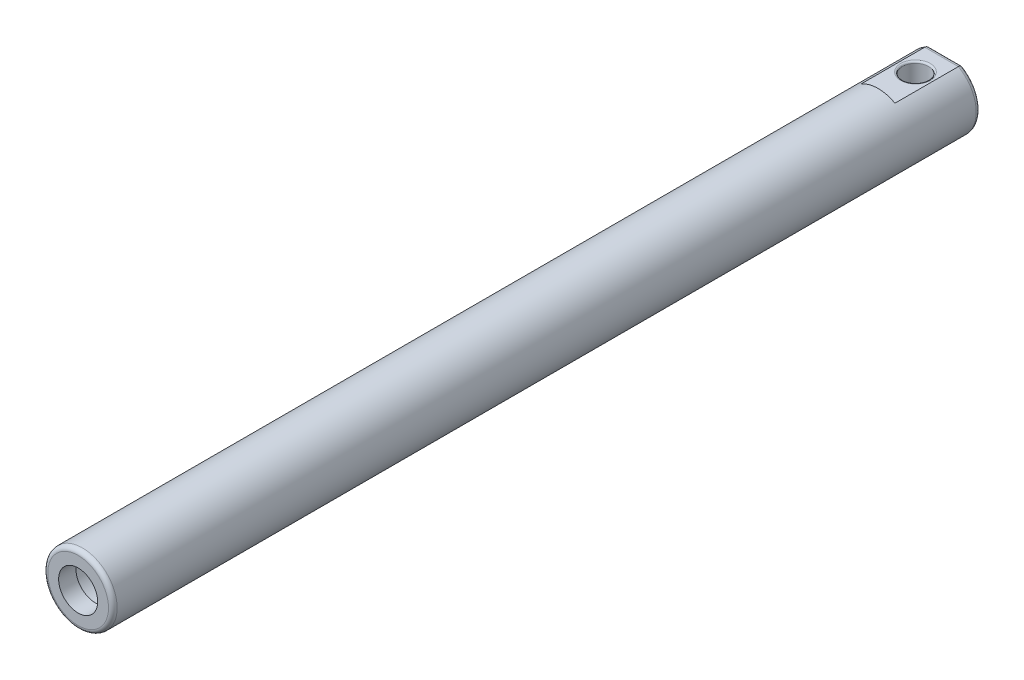
ISO-10303-21;
HEADER;
FILE_DESCRIPTION(('STEP AP214'),'2;1');
FILE_NAME('part.step','',(''),(''),'','','');
FILE_SCHEMA(('AUTOMOTIVE_DESIGN { 1 0 10303 214 1 1 1 1 }'));
ENDSEC;
DATA;
#1=APPLICATION_CONTEXT('core data for automotive mechanical design processes');
#2=APPLICATION_PROTOCOL_DEFINITION('international standard','automotive_design',2000,#1);
#3=PRODUCT_CONTEXT('',#1,'mechanical');
#4=PRODUCT('Part','Part','',(#3));
#5=PRODUCT_RELATED_PRODUCT_CATEGORY('part','',(#4));
#6=PRODUCT_DEFINITION_FORMATION('','',#4);
#7=PRODUCT_DEFINITION_CONTEXT('part definition',#1,'design');
#8=PRODUCT_DEFINITION('design','',#6,#7);
#9=PRODUCT_DEFINITION_SHAPE('','',#8);
#10=(LENGTH_UNIT() NAMED_UNIT(*) SI_UNIT(.MILLI.,.METRE.));
#11=(NAMED_UNIT(*) PLANE_ANGLE_UNIT() SI_UNIT($,.RADIAN.));
#12=(NAMED_UNIT(*) SI_UNIT($,.STERADIAN.) SOLID_ANGLE_UNIT());
#13=UNCERTAINTY_MEASURE_WITH_UNIT(LENGTH_MEASURE(1.E-05),#10,'distance_accuracy_value','');
#14=(GEOMETRIC_REPRESENTATION_CONTEXT(3) GLOBAL_UNCERTAINTY_ASSIGNED_CONTEXT((#13)) GLOBAL_UNIT_ASSIGNED_CONTEXT((#10,
#11,#12)) REPRESENTATION_CONTEXT('',''));
#15=CARTESIAN_POINT('',(0.,0.,0.));
#16=DIRECTION('',(0.,0.,1.));
#17=DIRECTION('',(1.,0.,0.));
#18=AXIS2_PLACEMENT_3D('',#15,#16,#17);
#19=CARTESIAN_POINT('',(0.,0.,920.));
#20=DIRECTION('',(0.,0.,-1.));
#21=DIRECTION('',(-1.,0.,0.));
#22=AXIS2_PLACEMENT_3D('',#19,#20,#21);
#23=CYLINDRICAL_SURFACE('',#22,40.);
#24=CARTESIAN_POINT('',(0.,0.,915.));
#25=DIRECTION('',(0.,0.,1.));
#26=DIRECTION('',(1.,0.,0.));
#27=AXIS2_PLACEMENT_3D('',#24,#25,#26);
#28=CIRCLE('',#27,40.);
#29=CARTESIAN_POINT('',(40.,0.,915.));
#30=VERTEX_POINT('',#29);
#31=EDGE_CURVE('E182',#30,#30,#28,.F.);
#32=ORIENTED_EDGE('',*,*,#31,.T.);
#33=EDGE_LOOP('',(#32));
#34=FACE_BOUND('',#33,.T.);
#35=DIRECTION('',(0.,0.,-1.));
#36=VECTOR('',#35,1.);
#37=CARTESIAN_POINT('',(19.3649167310371,-35.,920.));
#38=LINE('',#37,#36);
#39=CARTESIAN_POINT('',(19.3649167310371,-35.,-2.));
#40=VERTEX_POINT('',#39);
#41=CARTESIAN_POINT('',(19.3649167310371,-35.,-75.));
#42=VERTEX_POINT('',#41);
#43=EDGE_CURVE('E115',#40,#42,#38,.T.);
#44=ORIENTED_EDGE('',*,*,#43,.T.);
#45=CARTESIAN_POINT('',(0.,0.,-75.));
#46=DIRECTION('',(0.,0.,-1.));
#47=DIRECTION('',(-1.,0.,0.));
#48=AXIS2_PLACEMENT_3D('',#45,#46,#47);
#49=CIRCLE('',#48,40.);
#50=CARTESIAN_POINT('',(19.3649167310371,35.,-75.));
#51=VERTEX_POINT('',#50);
#52=EDGE_CURVE('E75',#42,#51,#49,.F.);
#53=ORIENTED_EDGE('',*,*,#52,.T.);
#54=DIRECTION('',(0.,0.,-1.));
#55=VECTOR('',#54,1.);
#56=CARTESIAN_POINT('',(19.3649167310371,35.,920.));
#57=LINE('',#56,#55);
#58=CARTESIAN_POINT('',(19.3649167310371,35.,-2.));
#59=VERTEX_POINT('',#58);
#60=EDGE_CURVE('E140',#51,#59,#57,.F.);
#61=ORIENTED_EDGE('',*,*,#60,.T.);
#62=CARTESIAN_POINT('',(0.,0.,-2.));
#63=DIRECTION('',(0.,0.,1.));
#64=DIRECTION('',(1.,0.,0.));
#65=AXIS2_PLACEMENT_3D('',#62,#63,#64);
#66=CIRCLE('',#65,40.);
#67=CARTESIAN_POINT('',(-19.3649167310371,35.,-2.));
#68=VERTEX_POINT('',#67);
#69=EDGE_CURVE('E123',#59,#68,#66,.T.);
#70=ORIENTED_EDGE('',*,*,#69,.T.);
#71=DIRECTION('',(0.,0.,-1.));
#72=VECTOR('',#71,1.);
#73=CARTESIAN_POINT('',(-19.3649167310371,35.,920.));
#74=LINE('',#73,#72);
#75=CARTESIAN_POINT('',(-19.3649167310371,35.,-75.));
#76=VERTEX_POINT('',#75);
#77=EDGE_CURVE('E143',#68,#76,#74,.T.);
#78=ORIENTED_EDGE('',*,*,#77,.T.);
#79=CARTESIAN_POINT('',(0.,0.,-75.));
#80=DIRECTION('',(0.,0.,-1.));
#81=DIRECTION('',(-1.,0.,0.));
#82=AXIS2_PLACEMENT_3D('',#79,#80,#81);
#83=CIRCLE('',#82,40.);
#84=CARTESIAN_POINT('',(-19.3649167310371,-35.,-75.));
#85=VERTEX_POINT('',#84);
#86=EDGE_CURVE('E109',#76,#85,#83,.F.);
#87=ORIENTED_EDGE('',*,*,#86,.T.);
#88=DIRECTION('',(0.,0.,-1.));
#89=VECTOR('',#88,1.);
#90=CARTESIAN_POINT('',(-19.3649167310371,-35.,920.));
#91=LINE('',#90,#89);
#92=CARTESIAN_POINT('',(-19.3649167310371,-35.,-2.));
#93=VERTEX_POINT('',#92);
#94=EDGE_CURVE('E104',#85,#93,#91,.F.);
#95=ORIENTED_EDGE('',*,*,#94,.T.);
#96=CARTESIAN_POINT('',(0.,0.,-2.));
#97=DIRECTION('',(0.,0.,-1.));
#98=DIRECTION('',(-1.,0.,0.));
#99=AXIS2_PLACEMENT_3D('',#96,#97,#98);
#100=CIRCLE('',#99,40.);
#101=EDGE_CURVE('E106',#40,#93,#100,.T.);
#102=ORIENTED_EDGE('',*,*,#101,.F.);
#103=EDGE_LOOP('',(#44,#53,#61,#70,#78,#87,#95,#102));
#104=FACE_BOUND('',#103,.T.);
#105=ADVANCED_FACE('F51',(#34,#104),#23,.T.);
#106=CARTESIAN_POINT('',(0.,0.,920.));
#107=DIRECTION('',(0.,0.,1.));
#108=DIRECTION('',(1.,0.,0.));
#109=AXIS2_PLACEMENT_3D('',#106,#107,#108);
#110=PLANE('',#109);
#111=CARTESIAN_POINT('',(0.,0.,920.));
#112=DIRECTION('',(0.,0.,1.));
#113=DIRECTION('',(1.,0.,0.));
#114=AXIS2_PLACEMENT_3D('',#111,#112,#113);
#115=CIRCLE('',#114,35.);
#116=CARTESIAN_POINT('',(35.,0.,920.));
#117=VERTEX_POINT('',#116);
#118=EDGE_CURVE('E190',#117,#117,#115,.T.);
#119=ORIENTED_EDGE('',*,*,#118,.T.);
#120=EDGE_LOOP('',(#119));
#121=FACE_BOUND('',#120,.T.);
#122=CARTESIAN_POINT('',(0.,0.,920.));
#123=DIRECTION('',(0.,0.,1.));
#124=DIRECTION('',(1.,0.,0.));
#125=AXIS2_PLACEMENT_3D('',#122,#123,#124);
#126=CIRCLE('',#125,22.5);
#127=CARTESIAN_POINT('',(22.5,0.,920.));
#128=VERTEX_POINT('',#127);
#129=EDGE_CURVE('E147',#128,#128,#126,.T.);
#130=ORIENTED_EDGE('',*,*,#129,.F.);
#131=EDGE_LOOP('',(#130));
#132=FACE_BOUND('',#131,.T.);
#133=ADVANCED_FACE('F266',(#121,#132),#110,.T.);
#134=CARTESIAN_POINT('',(0.,0.,900.));
#135=DIRECTION('',(0.,0.,-1.));
#136=DIRECTION('',(-1.,0.,0.));
#137=AXIS2_PLACEMENT_3D('',#134,#135,#136);
#138=CYLINDRICAL_SURFACE('',#137,30.);
#139=CARTESIAN_POINT('',(0.,0.,900.));
#140=DIRECTION('',(0.,0.,-1.));
#141=DIRECTION('',(-1.,0.,0.));
#142=AXIS2_PLACEMENT_3D('',#139,#140,#141);
#143=CIRCLE('',#142,30.);
#144=CARTESIAN_POINT('',(-30.,0.,900.));
#145=VERTEX_POINT('',#144);
#146=EDGE_CURVE('E151',#145,#145,#143,.T.);
#147=ORIENTED_EDGE('',*,*,#146,.F.);
#148=EDGE_LOOP('',(#147));
#149=FACE_BOUND('',#148,.T.);
#150=CARTESIAN_POINT('',(0.,0.,0.));
#151=DIRECTION('',(0.,0.,-1.));
#152=DIRECTION('',(-1.,0.,0.));
#153=AXIS2_PLACEMENT_3D('',#150,#151,#152);
#154=CIRCLE('',#153,30.);
#155=CARTESIAN_POINT('',(-30.,0.,0.));
#156=VERTEX_POINT('',#155);
#157=EDGE_CURVE('E146',#156,#156,#154,.T.);
#158=ORIENTED_EDGE('',*,*,#157,.T.);
#159=EDGE_LOOP('',(#158));
#160=FACE_BOUND('',#159,.T.);
#161=ADVANCED_FACE('F271',(#149,#160),#138,.F.);
#162=CARTESIAN_POINT('',(0.,0.,900.));
#163=DIRECTION('',(0.,0.,-1.));
#164=DIRECTION('',(-1.,0.,0.));
#165=AXIS2_PLACEMENT_3D('',#162,#163,#164);
#166=PLANE('',#165);
#167=CARTESIAN_POINT('',(0.,0.,900.));
#168=DIRECTION('',(0.,0.,-1.));
#169=DIRECTION('',(-1.,0.,0.));
#170=AXIS2_PLACEMENT_3D('',#167,#168,#169);
#171=CIRCLE('',#170,22.5);
#172=CARTESIAN_POINT('',(-22.5,0.,900.));
#173=VERTEX_POINT('',#172);
#174=EDGE_CURVE('E152',#173,#173,#171,.F.);
#175=ORIENTED_EDGE('',*,*,#174,.T.);
#176=EDGE_LOOP('',(#175));
#177=FACE_BOUND('',#176,.T.);
#178=ORIENTED_EDGE('',*,*,#146,.T.);
#179=EDGE_LOOP('',(#178));
#180=FACE_BOUND('',#179,.T.);
#181=ADVANCED_FACE('F277',(#177,#180),#166,.T.);
#182=CARTESIAN_POINT('',(0.,0.,-0.00100000000002876));
#183=DIRECTION('',(0.,0.,1.));
#184=DIRECTION('',(1.,0.,0.));
#185=AXIS2_PLACEMENT_3D('',#182,#183,#184);
#186=CYLINDRICAL_SURFACE('',#185,22.5);
#187=ORIENTED_EDGE('',*,*,#174,.F.);
#188=EDGE_LOOP('',(#187));
#189=FACE_BOUND('',#188,.T.);
#190=ORIENTED_EDGE('',*,*,#129,.T.);
#191=EDGE_LOOP('',(#190));
#192=FACE_BOUND('',#191,.T.);
#193=ADVANCED_FACE('F281',(#189,#192),#186,.F.);
#194=CARTESIAN_POINT('',(0.,0.,0.));
#195=DIRECTION('',(0.,0.,-1.));
#196=DIRECTION('',(-1.,0.,0.));
#197=AXIS2_PLACEMENT_3D('',#194,#195,#196);
#198=PLANE('',#197);
#199=ORIENTED_EDGE('',*,*,#157,.F.);
#200=EDGE_LOOP('',(#199));
#201=FACE_BOUND('',#200,.T.);
#202=ADVANCED_FACE('F285',(#201),#198,.F.);
#203=CARTESIAN_POINT('',(0.,0.,-80.));
#204=DIRECTION('',(0.,0.,-1.));
#205=DIRECTION('',(-1.,0.,0.));
#206=AXIS2_PLACEMENT_3D('',#203,#204,#205);
#207=PLANE('',#206);
#208=DIRECTION('',(-1.,0.,0.));
#209=VECTOR('',#208,1.);
#210=CARTESIAN_POINT('',(19.3649167310371,30.,-80.));
#211=LINE('',#210,#209);
#212=CARTESIAN_POINT('',(-18.0277563773199,30.,-80.));
#213=VERTEX_POINT('',#212);
#214=CARTESIAN_POINT('',(18.0277563773199,30.,-80.));
#215=VERTEX_POINT('',#214);
#216=EDGE_CURVE('E170',#213,#215,#211,.F.);
#217=ORIENTED_EDGE('',*,*,#216,.T.);
#218=CARTESIAN_POINT('',(0.,0.,-80.));
#219=DIRECTION('',(0.,0.,-1.));
#220=DIRECTION('',(-1.,0.,0.));
#221=AXIS2_PLACEMENT_3D('',#218,#219,#220);
#222=CIRCLE('',#221,35.);
#223=CARTESIAN_POINT('',(18.0277563773199,-30.,-80.));
#224=VERTEX_POINT('',#223);
#225=EDGE_CURVE('E177',#215,#224,#222,.T.);
#226=ORIENTED_EDGE('',*,*,#225,.T.);
#227=DIRECTION('',(1.,0.,0.));
#228=VECTOR('',#227,1.);
#229=CARTESIAN_POINT('',(-19.3649167310371,-30.,-80.));
#230=LINE('',#229,#228);
#231=CARTESIAN_POINT('',(-18.0277563773199,-30.,-80.));
#232=VERTEX_POINT('',#231);
#233=EDGE_CURVE('E173',#224,#232,#230,.F.);
#234=ORIENTED_EDGE('',*,*,#233,.T.);
#235=CARTESIAN_POINT('',(0.,0.,-80.));
#236=DIRECTION('',(0.,0.,-1.));
#237=DIRECTION('',(-1.,0.,0.));
#238=AXIS2_PLACEMENT_3D('',#235,#236,#237);
#239=CIRCLE('',#238,35.);
#240=EDGE_CURVE('E167',#232,#213,#239,.T.);
#241=ORIENTED_EDGE('',*,*,#240,.T.);
#242=EDGE_LOOP('',(#217,#226,#234,#241));
#243=FACE_BOUND('',#242,.T.);
#244=ADVANCED_FACE('F289',(#243),#207,.T.);
#245=CARTESIAN_POINT('',(20.,35.,-2.));
#246=DIRECTION('',(0.,0.,1.));
#247=DIRECTION('',(1.,0.,0.));
#248=AXIS2_PLACEMENT_3D('',#245,#246,#247);
#249=PLANE('',#248);
#250=DIRECTION('',(1.,0.,0.));
#251=VECTOR('',#250,1.);
#252=CARTESIAN_POINT('',(20.,35.,-2.));
#253=LINE('',#252,#251);
#254=EDGE_CURVE('E136',#68,#59,#253,.T.);
#255=ORIENTED_EDGE('',*,*,#254,.F.);
#256=ORIENTED_EDGE('',*,*,#69,.F.);
#257=EDGE_LOOP('',(#255,#256));
#258=FACE_BOUND('',#257,.T.);
#259=ADVANCED_FACE('F293',(#258),#249,.F.);
#260=CARTESIAN_POINT('',(0.,35.,0.));
#261=DIRECTION('',(0.,-1.,0.));
#262=DIRECTION('',(0.,0.,-1.));
#263=AXIS2_PLACEMENT_3D('',#260,#261,#262);
#264=PLANE('',#263);
#265=CARTESIAN_POINT('',(0.,35.,-45.));
#266=DIRECTION('',(0.,-1.,0.));
#267=DIRECTION('',(0.,0.,-1.));
#268=AXIS2_PLACEMENT_3D('',#265,#266,#267);
#269=CIRCLE('',#268,17.);
#270=CARTESIAN_POINT('',(0.,35.,-62.));
#271=VERTEX_POINT('',#270);
#272=EDGE_CURVE('E11',#271,#271,#269,.T.);
#273=ORIENTED_EDGE('',*,*,#272,.T.);
#274=EDGE_LOOP('',(#273));
#275=FACE_BOUND('',#274,.T.);
#276=ORIENTED_EDGE('',*,*,#60,.F.);
#277=DIRECTION('',(-1.,0.,0.));
#278=VECTOR('',#277,1.);
#279=CARTESIAN_POINT('',(-19.3649167310371,35.,-75.));
#280=LINE('',#279,#278);
#281=EDGE_CURVE('E67',#51,#76,#280,.T.);
#282=ORIENTED_EDGE('',*,*,#281,.T.);
#283=ORIENTED_EDGE('',*,*,#77,.F.);
#284=ORIENTED_EDGE('',*,*,#254,.T.);
#285=EDGE_LOOP('',(#276,#282,#283,#284));
#286=FACE_BOUND('',#285,.T.);
#287=ADVANCED_FACE('F263',(#275,#286),#264,.F.);
#288=CARTESIAN_POINT('',(20.,-35.,-2.));
#289=DIRECTION('',(0.,0.,-1.));
#290=DIRECTION('',(-1.,0.,0.));
#291=AXIS2_PLACEMENT_3D('',#288,#289,#290);
#292=PLANE('',#291);
#293=DIRECTION('',(1.,0.,0.));
#294=VECTOR('',#293,1.);
#295=CARTESIAN_POINT('',(20.,-35.,-2.));
#296=LINE('',#295,#294);
#297=EDGE_CURVE('E116',#93,#40,#296,.T.);
#298=ORIENTED_EDGE('',*,*,#297,.T.);
#299=ORIENTED_EDGE('',*,*,#101,.T.);
#300=EDGE_LOOP('',(#298,#299));
#301=FACE_BOUND('',#300,.T.);
#302=ADVANCED_FACE('F120',(#301),#292,.T.);
#303=CARTESIAN_POINT('',(0.,-35.,0.));
#304=DIRECTION('',(0.,1.,0.));
#305=DIRECTION('',(0.,0.,-1.));
#306=AXIS2_PLACEMENT_3D('',#303,#304,#305);
#307=PLANE('',#306);
#308=CARTESIAN_POINT('',(0.,-35.,-45.));
#309=DIRECTION('',(0.,1.,0.));
#310=DIRECTION('',(0.,0.,1.));
#311=AXIS2_PLACEMENT_3D('',#308,#309,#310);
#312=CIRCLE('',#311,17.);
#313=CARTESIAN_POINT('',(0.,-35.,-28.));
#314=VERTEX_POINT('',#313);
#315=EDGE_CURVE('E194',#314,#314,#312,.T.);
#316=ORIENTED_EDGE('',*,*,#315,.T.);
#317=EDGE_LOOP('',(#316));
#318=FACE_BOUND('',#317,.T.);
#319=ORIENTED_EDGE('',*,*,#94,.F.);
#320=DIRECTION('',(1.,0.,0.));
#321=VECTOR('',#320,1.);
#322=CARTESIAN_POINT('',(19.3649167310371,-35.,-75.));
#323=LINE('',#322,#321);
#324=EDGE_CURVE('E122',#85,#42,#323,.T.);
#325=ORIENTED_EDGE('',*,*,#324,.T.);
#326=ORIENTED_EDGE('',*,*,#43,.F.);
#327=ORIENTED_EDGE('',*,*,#297,.F.);
#328=EDGE_LOOP('',(#319,#325,#326,#327));
#329=FACE_BOUND('',#328,.T.);
#330=ADVANCED_FACE('F125',(#318,#329),#307,.F.);
#331=CARTESIAN_POINT('',(0.,-40.,-45.));
#332=DIRECTION('',(0.,1.,0.));
#333=DIRECTION('',(0.,0.,1.));
#334=AXIS2_PLACEMENT_3D('',#331,#332,#333);
#335=CYLINDRICAL_SURFACE('',#334,15.);
#336=CARTESIAN_POINT('',(0.,-33.,-45.));
#337=DIRECTION('',(0.,1.,0.));
#338=DIRECTION('',(0.,0.,1.));
#339=AXIS2_PLACEMENT_3D('',#336,#337,#338);
#340=CIRCLE('',#339,15.);
#341=CARTESIAN_POINT('',(0.,-33.,-30.));
#342=VERTEX_POINT('',#341);
#343=EDGE_CURVE('E60',#342,#342,#340,.F.);
#344=ORIENTED_EDGE('',*,*,#343,.T.);
#345=EDGE_LOOP('',(#344));
#346=FACE_BOUND('',#345,.T.);
#347=CARTESIAN_POINT('',(0.,33.,-45.));
#348=DIRECTION('',(0.,-1.,0.));
#349=DIRECTION('',(0.,0.,-1.));
#350=AXIS2_PLACEMENT_3D('',#347,#348,#349);
#351=CIRCLE('',#350,15.);
#352=CARTESIAN_POINT('',(0.,33.,-60.));
#353=VERTEX_POINT('',#352);
#354=EDGE_CURVE('E241',#353,#353,#351,.F.);
#355=ORIENTED_EDGE('',*,*,#354,.T.);
#356=EDGE_LOOP('',(#355));
#357=FACE_BOUND('',#356,.T.);
#358=ADVANCED_FACE('F248',(#346,#357),#335,.F.);
#359=CARTESIAN_POINT('',(0.,30.,-75.));
#360=DIRECTION('',(1.,0.,0.));
#361=DIRECTION('',(0.,0.,-1.));
#362=AXIS2_PLACEMENT_3D('',#359,#360,#361);
#363=CYLINDRICAL_SURFACE('',#362,5.);
#364=CARTESIAN_POINT('',(19.3649167310371,35.,-75.));
#365=CARTESIAN_POINT('',(19.3649205000472,35.0000173063587,-75.1373300823665));
#366=CARTESIAN_POINT('',(19.3634560485535,34.9943428859047,-75.2746564596589));
#367=CARTESIAN_POINT('',(19.3576181535194,34.9717364820633,-75.5483028599108));
#368=CARTESIAN_POINT('',(19.3532450243962,34.9548057154452,-75.6846229900316));
#369=CARTESIAN_POINT('',(19.3416261638452,34.9098470979698,-75.9550796892258));
#370=CARTESIAN_POINT('',(19.3343848657595,34.8818363735429,-76.089219297175));
#371=CARTESIAN_POINT('',(19.3170824375607,34.8149598614034,-76.3545774983744));
#372=CARTESIAN_POINT('',(19.3070213095175,34.776094081659,-76.4857960937687));
#373=CARTESIAN_POINT('',(19.2841501344436,34.687831589201,-76.744391346056));
#374=CARTESIAN_POINT('',(19.2713401412811,34.6384350828529,-76.8717680781803));
#375=CARTESIAN_POINT('',(19.243055117451,34.5294970244326,-77.1218544476447));
#376=CARTESIAN_POINT('',(19.227579104266,34.4699517322799,-77.244562343936));
#377=CARTESIAN_POINT('',(19.1940775483915,34.3412332572752,-77.4843930463797));
#378=CARTESIAN_POINT('',(19.1760529723852,34.2720637251054,-77.6015179477709));
#379=CARTESIAN_POINT('',(19.1375638119285,34.124597829654,-77.8295109361486));
#380=CARTESIAN_POINT('',(19.117098317491,34.046298062818,-77.9403766668469));
#381=CARTESIAN_POINT('',(19.0735926187459,33.8801456430502,-78.1564662131131));
#382=CARTESIAN_POINT('',(19.0505230515161,33.7921844263202,-78.2616006388834));
#383=CARTESIAN_POINT('',(19.002169019412,33.6081842659147,-78.4640623934138));
#384=CARTESIAN_POINT('',(18.9768837413685,33.512142357132,-78.5613868305795));
#385=CARTESIAN_POINT('',(18.9242680250719,33.3127229039831,-78.747594915808));
#386=CARTESIAN_POINT('',(18.8969377463806,33.2093459319697,-78.8364792211889));
#387=CARTESIAN_POINT('',(18.8404030529093,32.9959985980433,-79.0053126202323));
#388=CARTESIAN_POINT('',(18.8111979601327,32.8860258518291,-79.0852584524563));
#389=CARTESIAN_POINT('',(18.7192365267778,32.5405997889943,-79.3154703404752));
#390=CARTESIAN_POINT('',(18.6536900291752,32.2955480443498,-79.4505909558367));
#391=CARTESIAN_POINT('',(18.5170986094454,31.7878283565191,-79.6777186987532));
#392=CARTESIAN_POINT('',(18.4460547666256,31.5251638726303,-79.7697342643314));
#393=CARTESIAN_POINT('',(18.3180343369613,31.0547331089382,-79.8919752896393));
#394=CARTESIAN_POINT('',(18.2618464490953,30.8491792251673,-79.9317922569325));
#395=CARTESIAN_POINT('',(18.1481818780843,30.4353289121657,-79.9853665718674));
#396=CARTESIAN_POINT('',(18.0907078242059,30.2270383835736,-79.9991729045455));
#397=CARTESIAN_POINT('',(18.031267028585,30.0126587518752,-79.9999880102739));
#398=CARTESIAN_POINT('',(18.029511794121,30.0063292392071,-80.000000029633));
#399=CARTESIAN_POINT('',(18.0277563773199,30.,-80.));
#400=B_SPLINE_CURVE_WITH_KNOTS('',3,(#364,#365,#366,#367,#368,#369,#370,#371,#372,#373,#374,
#375,#376,#377,#378,#379,#380,#381,#382,#383,#384,#385,#386,#387,#388,#389,#390,#391,#392,#393,
#394,#395,#396,#397,#398,#399),.UNSPECIFIED.,.F.,.F.,(4,2,2,2,2,2,2,2,2,2,2,2,2,2,2,2,2,4),(0.,
0.411859747012875,0.823674980748592,1.23485613841729,1.64603699425728,2.05720979312632,
2.4685344483561,2.87970350246263,3.29102632450074,3.70756593899941,4.12425906962487,
4.54091972149952,4.95773191028553,5.81576637716104,6.67363280935225,7.32253664582529,
7.97021719507691,7.98992230705254),.UNSPECIFIED.);
#401=EDGE_CURVE('E131',#215,#51,#400,.F.);
#402=ORIENTED_EDGE('',*,*,#401,.F.);
#403=ORIENTED_EDGE('',*,*,#216,.F.);
#404=CARTESIAN_POINT('',(-19.3649167310371,35.,-75.));
#405=CARTESIAN_POINT('',(-19.3649205000472,35.0000173063587,-75.1373300823665));
#406=CARTESIAN_POINT('',(-19.3634560485535,34.9943428859047,-75.2746564596589));
#407=CARTESIAN_POINT('',(-19.3576181535194,34.9717364820633,-75.5483028599108));
#408=CARTESIAN_POINT('',(-19.3532450243962,34.9548057154452,-75.6846229900316));
#409=CARTESIAN_POINT('',(-19.3416261638452,34.9098470979698,-75.9550796892258));
#410=CARTESIAN_POINT('',(-19.3343848657595,34.8818363735429,-76.089219297175));
#411=CARTESIAN_POINT('',(-19.3170824375607,34.8149598614034,-76.3545774983744));
#412=CARTESIAN_POINT('',(-19.3070213095175,34.776094081659,-76.4857960937687));
#413=CARTESIAN_POINT('',(-19.2841501344436,34.687831589201,-76.744391346056));
#414=CARTESIAN_POINT('',(-19.2713401412811,34.6384350828529,-76.8717680781803));
#415=CARTESIAN_POINT('',(-19.243055117451,34.5294970244326,-77.1218544476447));
#416=CARTESIAN_POINT('',(-19.227579104266,34.4699517322799,-77.244562343936));
#417=CARTESIAN_POINT('',(-19.1940775483915,34.3412332572752,-77.4843930463797));
#418=CARTESIAN_POINT('',(-19.1760529723852,34.2720637251054,-77.6015179477709));
#419=CARTESIAN_POINT('',(-19.1375638119285,34.124597829654,-77.8295109361486));
#420=CARTESIAN_POINT('',(-19.117098317491,34.046298062818,-77.9403766668469));
#421=CARTESIAN_POINT('',(-19.0735926187459,33.8801456430502,-78.1564662131131));
#422=CARTESIAN_POINT('',(-19.0505230515161,33.7921844263202,-78.2616006388834));
#423=CARTESIAN_POINT('',(-19.002169019412,33.6081842659147,-78.4640623934138));
#424=CARTESIAN_POINT('',(-18.9768837413685,33.512142357132,-78.5613868305795));
#425=CARTESIAN_POINT('',(-18.9242680250719,33.3127229039831,-78.747594915808));
#426=CARTESIAN_POINT('',(-18.8969377463806,33.2093459319697,-78.8364792211889));
#427=CARTESIAN_POINT('',(-18.8404030529093,32.9959985980433,-79.0053126202323));
#428=CARTESIAN_POINT('',(-18.8111979601327,32.8860258518291,-79.0852584524563));
#429=CARTESIAN_POINT('',(-18.7192365267778,32.5405997889943,-79.3154703404752));
#430=CARTESIAN_POINT('',(-18.6536900291752,32.2955480443498,-79.4505909558367));
#431=CARTESIAN_POINT('',(-18.5170986094454,31.7878283565191,-79.6777186987532));
#432=CARTESIAN_POINT('',(-18.4460547666256,31.5251638726303,-79.7697342643314));
#433=CARTESIAN_POINT('',(-18.3180343369613,31.0547331089382,-79.8919752896393));
#434=CARTESIAN_POINT('',(-18.2618464490953,30.8491792251673,-79.9317922569325));
#435=CARTESIAN_POINT('',(-18.1481818780843,30.4353289121657,-79.9853665718674));
#436=CARTESIAN_POINT('',(-18.0907078242059,30.2270383835736,-79.9991729045455));
#437=CARTESIAN_POINT('',(-18.031267028585,30.0126587518752,-79.9999880102739));
#438=CARTESIAN_POINT('',(-18.029511794121,30.0063292392071,-80.000000029633));
#439=CARTESIAN_POINT('',(-18.0277563773199,30.,-80.));
#440=B_SPLINE_CURVE_WITH_KNOTS('',3,(#404,#405,#406,#407,#408,#409,#410,#411,#412,#413,#414,
#415,#416,#417,#418,#419,#420,#421,#422,#423,#424,#425,#426,#427,#428,#429,#430,#431,#432,#433,
#434,#435,#436,#437,#438,#439),.UNSPECIFIED.,.F.,.F.,(4,2,2,2,2,2,2,2,2,2,2,2,2,2,2,2,2,4),(0.,
0.411859747012875,0.823674980748592,1.23485613841729,1.64603699425728,2.05720979312632,
2.4685344483561,2.87970350246263,3.29102632450074,3.70756593899941,4.12425906962487,
4.54091972149952,4.95773191028553,5.81576637716104,6.67363280935225,7.32253664582529,
7.97021719507691,7.98992230705254),.UNSPECIFIED.);
#441=EDGE_CURVE('E127',#76,#213,#440,.T.);
#442=ORIENTED_EDGE('',*,*,#441,.F.);
#443=ORIENTED_EDGE('',*,*,#281,.F.);
#444=EDGE_LOOP('',(#402,#403,#442,#443));
#445=FACE_BOUND('',#444,.T.);
#446=ADVANCED_FACE('F224',(#445),#363,.T.);
#447=CARTESIAN_POINT('',(0.,0.,-75.));
#448=DIRECTION('',(0.,0.,-1.));
#449=DIRECTION('',(-1.,0.,0.));
#450=AXIS2_PLACEMENT_3D('',#447,#448,#449);
#451=TOROIDAL_SURFACE('',#450,35.,5.);
#452=ORIENTED_EDGE('',*,*,#441,.T.);
#453=ORIENTED_EDGE('',*,*,#240,.F.);
#454=CARTESIAN_POINT('',(-19.3649167310371,-35.,-75.));
#455=CARTESIAN_POINT('',(-19.3649205000472,-35.0000173063587,-75.1373300823665));
#456=CARTESIAN_POINT('',(-19.3634560485535,-34.9943428859047,-75.2746564596589));
#457=CARTESIAN_POINT('',(-19.3576181535194,-34.9717364820633,-75.5483028599108));
#458=CARTESIAN_POINT('',(-19.3532450243962,-34.9548057154452,-75.6846229900316));
#459=CARTESIAN_POINT('',(-19.3416261638452,-34.9098470979698,-75.9550796892258));
#460=CARTESIAN_POINT('',(-19.3343848657595,-34.8818363735429,-76.089219297175));
#461=CARTESIAN_POINT('',(-19.3170824375607,-34.8149598614034,-76.3545774983744));
#462=CARTESIAN_POINT('',(-19.3070213095175,-34.776094081659,-76.4857960937687));
#463=CARTESIAN_POINT('',(-19.2841501344436,-34.687831589201,-76.744391346056));
#464=CARTESIAN_POINT('',(-19.2713401412811,-34.6384350828529,-76.8717680781803));
#465=CARTESIAN_POINT('',(-19.243055117451,-34.5294970244326,-77.1218544476447));
#466=CARTESIAN_POINT('',(-19.227579104266,-34.4699517322799,-77.244562343936));
#467=CARTESIAN_POINT('',(-19.1940775483915,-34.3412332572752,-77.4843930463797));
#468=CARTESIAN_POINT('',(-19.1760529723852,-34.2720637251054,-77.6015179477709));
#469=CARTESIAN_POINT('',(-19.1375638119285,-34.124597829654,-77.8295109361486));
#470=CARTESIAN_POINT('',(-19.117098317491,-34.046298062818,-77.9403766668469));
#471=CARTESIAN_POINT('',(-19.0735926187459,-33.8801456430502,-78.1564662131131));
#472=CARTESIAN_POINT('',(-19.0505230515161,-33.7921844263202,-78.2616006388834));
#473=CARTESIAN_POINT('',(-19.002169019412,-33.6081842659147,-78.4640623934138));
#474=CARTESIAN_POINT('',(-18.9768837413685,-33.512142357132,-78.5613868305795));
#475=CARTESIAN_POINT('',(-18.9242680250719,-33.3127229039831,-78.747594915808));
#476=CARTESIAN_POINT('',(-18.8969377463806,-33.2093459319697,-78.8364792211889));
#477=CARTESIAN_POINT('',(-18.8404030529093,-32.9959985980433,-79.0053126202323));
#478=CARTESIAN_POINT('',(-18.8111979601327,-32.8860258518291,-79.0852584524563));
#479=CARTESIAN_POINT('',(-18.7192365267778,-32.5405997889943,-79.3154703404752));
#480=CARTESIAN_POINT('',(-18.6536900291752,-32.2955480443498,-79.4505909558367));
#481=CARTESIAN_POINT('',(-18.5170986094454,-31.7878283565191,-79.6777186987532));
#482=CARTESIAN_POINT('',(-18.4460547666256,-31.5251638726303,-79.7697342643314));
#483=CARTESIAN_POINT('',(-18.3180343369613,-31.0547331089382,-79.8919752896393));
#484=CARTESIAN_POINT('',(-18.2618464490953,-30.8491792251673,-79.9317922569325));
#485=CARTESIAN_POINT('',(-18.1481818780843,-30.4353289121657,-79.9853665718674));
#486=CARTESIAN_POINT('',(-18.0907078242059,-30.2270383835736,-79.9991729045455));
#487=CARTESIAN_POINT('',(-18.031267028585,-30.0126587518752,-79.9999880102739));
#488=CARTESIAN_POINT('',(-18.029511794121,-30.0063292392071,-80.000000029633));
#489=CARTESIAN_POINT('',(-18.0277563773199,-30.,-80.));
#490=B_SPLINE_CURVE_WITH_KNOTS('',3,(#454,#455,#456,#457,#458,#459,#460,#461,#462,#463,#464,
#465,#466,#467,#468,#469,#470,#471,#472,#473,#474,#475,#476,#477,#478,#479,#480,#481,#482,#483,
#484,#485,#486,#487,#488,#489),.UNSPECIFIED.,.F.,.F.,(4,2,2,2,2,2,2,2,2,2,2,2,2,2,2,2,2,4),(0.,
0.411859747012875,0.823674980748592,1.23485613841729,1.64603699425728,2.05720979312632,
2.4685344483561,2.87970350246263,3.29102632450074,3.70756593899941,4.12425906962487,
4.54091972149952,4.95773191028553,5.81576637716104,6.67363280935225,7.32253664582529,
7.97021719507691,7.98992230705254),.UNSPECIFIED.);
#491=EDGE_CURVE('E204',#85,#232,#490,.T.);
#492=ORIENTED_EDGE('',*,*,#491,.F.);
#493=ORIENTED_EDGE('',*,*,#86,.F.);
#494=EDGE_LOOP('',(#452,#453,#492,#493));
#495=FACE_BOUND('',#494,.T.);
#496=ADVANCED_FACE('F219',(#495),#451,.T.);
#497=CARTESIAN_POINT('',(0.,0.,-75.));
#498=DIRECTION('',(0.,0.,-1.));
#499=DIRECTION('',(-1.,0.,0.));
#500=AXIS2_PLACEMENT_3D('',#497,#498,#499);
#501=TOROIDAL_SURFACE('',#500,35.,5.);
#502=ORIENTED_EDGE('',*,*,#401,.T.);
#503=ORIENTED_EDGE('',*,*,#52,.F.);
#504=CARTESIAN_POINT('',(19.3649167310371,-35.,-75.));
#505=CARTESIAN_POINT('',(19.3649205000472,-35.0000173063587,-75.1373300823665));
#506=CARTESIAN_POINT('',(19.3634560485535,-34.9943428859047,-75.2746564596589));
#507=CARTESIAN_POINT('',(19.3576181535194,-34.9717364820633,-75.5483028599108));
#508=CARTESIAN_POINT('',(19.3532450243962,-34.9548057154452,-75.6846229900316));
#509=CARTESIAN_POINT('',(19.3416261638452,-34.9098470979698,-75.9550796892258));
#510=CARTESIAN_POINT('',(19.3343848657595,-34.8818363735429,-76.089219297175));
#511=CARTESIAN_POINT('',(19.3170824375607,-34.8149598614034,-76.3545774983744));
#512=CARTESIAN_POINT('',(19.3070213095175,-34.776094081659,-76.4857960937687));
#513=CARTESIAN_POINT('',(19.2841501344436,-34.687831589201,-76.744391346056));
#514=CARTESIAN_POINT('',(19.2713401412811,-34.6384350828529,-76.8717680781803));
#515=CARTESIAN_POINT('',(19.243055117451,-34.5294970244326,-77.1218544476447));
#516=CARTESIAN_POINT('',(19.227579104266,-34.4699517322799,-77.244562343936));
#517=CARTESIAN_POINT('',(19.1940775483915,-34.3412332572752,-77.4843930463797));
#518=CARTESIAN_POINT('',(19.1760529723852,-34.2720637251054,-77.6015179477709));
#519=CARTESIAN_POINT('',(19.1375638119285,-34.124597829654,-77.8295109361486));
#520=CARTESIAN_POINT('',(19.117098317491,-34.046298062818,-77.9403766668469));
#521=CARTESIAN_POINT('',(19.0735926187459,-33.8801456430502,-78.1564662131131));
#522=CARTESIAN_POINT('',(19.0505230515161,-33.7921844263202,-78.2616006388834));
#523=CARTESIAN_POINT('',(19.002169019412,-33.6081842659147,-78.4640623934138));
#524=CARTESIAN_POINT('',(18.9768837413685,-33.512142357132,-78.5613868305795));
#525=CARTESIAN_POINT('',(18.9242680250719,-33.3127229039831,-78.747594915808));
#526=CARTESIAN_POINT('',(18.8969377463806,-33.2093459319697,-78.8364792211889));
#527=CARTESIAN_POINT('',(18.8404030529093,-32.9959985980433,-79.0053126202323));
#528=CARTESIAN_POINT('',(18.8111979601327,-32.8860258518291,-79.0852584524563));
#529=CARTESIAN_POINT('',(18.7192365267778,-32.5405997889943,-79.3154703404752));
#530=CARTESIAN_POINT('',(18.6536900291752,-32.2955480443498,-79.4505909558367));
#531=CARTESIAN_POINT('',(18.5170986094454,-31.7878283565191,-79.6777186987532));
#532=CARTESIAN_POINT('',(18.4460547666256,-31.5251638726303,-79.7697342643314));
#533=CARTESIAN_POINT('',(18.3180343369613,-31.0547331089382,-79.8919752896393));
#534=CARTESIAN_POINT('',(18.2618464490953,-30.8491792251673,-79.9317922569325));
#535=CARTESIAN_POINT('',(18.1481818780843,-30.4353289121657,-79.9853665718674));
#536=CARTESIAN_POINT('',(18.0907078242059,-30.2270383835736,-79.9991729045455));
#537=CARTESIAN_POINT('',(18.031267028585,-30.0126587518752,-79.9999880102739));
#538=CARTESIAN_POINT('',(18.029511794121,-30.0063292392071,-80.000000029633));
#539=CARTESIAN_POINT('',(18.0277563773199,-30.,-80.));
#540=B_SPLINE_CURVE_WITH_KNOTS('',3,(#504,#505,#506,#507,#508,#509,#510,#511,#512,#513,#514,
#515,#516,#517,#518,#519,#520,#521,#522,#523,#524,#525,#526,#527,#528,#529,#530,#531,#532,#533,
#534,#535,#536,#537,#538,#539),.UNSPECIFIED.,.F.,.F.,(4,2,2,2,2,2,2,2,2,2,2,2,2,2,2,2,2,4),(0.,
0.411859747012875,0.823674980748592,1.23485613841729,1.64603699425728,2.05720979312632,
2.4685344483561,2.87970350246263,3.29102632450074,3.70756593899941,4.12425906962487,
4.54091972149952,4.95773191028553,5.81576637716104,6.67363280935225,7.32253664582529,
7.97021719507691,7.98992230705254),.UNSPECIFIED.);
#541=EDGE_CURVE('E195',#224,#42,#540,.F.);
#542=ORIENTED_EDGE('',*,*,#541,.F.);
#543=ORIENTED_EDGE('',*,*,#225,.F.);
#544=EDGE_LOOP('',(#502,#503,#542,#543));
#545=FACE_BOUND('',#544,.T.);
#546=ADVANCED_FACE('F211',(#545),#501,.T.);
#547=CARTESIAN_POINT('',(0.,-30.,-75.));
#548=DIRECTION('',(-1.,0.,0.));
#549=DIRECTION('',(0.,0.,1.));
#550=AXIS2_PLACEMENT_3D('',#547,#548,#549);
#551=CYLINDRICAL_SURFACE('',#550,5.);
#552=ORIENTED_EDGE('',*,*,#491,.T.);
#553=ORIENTED_EDGE('',*,*,#233,.F.);
#554=ORIENTED_EDGE('',*,*,#541,.T.);
#555=ORIENTED_EDGE('',*,*,#324,.F.);
#556=EDGE_LOOP('',(#552,#553,#554,#555));
#557=FACE_BOUND('',#556,.T.);
#558=ADVANCED_FACE('F214',(#557),#551,.T.);
#559=CARTESIAN_POINT('',(0.,0.,915.));
#560=DIRECTION('',(0.,0.,1.));
#561=DIRECTION('',(1.,0.,0.));
#562=AXIS2_PLACEMENT_3D('',#559,#560,#561);
#563=TOROIDAL_SURFACE('',#562,35.,5.);
#564=ORIENTED_EDGE('',*,*,#31,.F.);
#565=EDGE_LOOP('',(#564));
#566=FACE_BOUND('',#565,.T.);
#567=ORIENTED_EDGE('',*,*,#118,.F.);
#568=EDGE_LOOP('',(#567));
#569=FACE_BOUND('',#568,.T.);
#570=ADVANCED_FACE('F217',(#566,#569),#563,.T.);
#571=CARTESIAN_POINT('',(0.,-33.,-45.));
#572=DIRECTION('',(0.,1.,0.));
#573=DIRECTION('',(0.,0.,1.));
#574=AXIS2_PLACEMENT_3D('',#571,#572,#573);
#575=TOROIDAL_SURFACE('',#574,17.,2.);
#576=ORIENTED_EDGE('',*,*,#343,.F.);
#577=EDGE_LOOP('',(#576));
#578=FACE_BOUND('',#577,.T.);
#579=ORIENTED_EDGE('',*,*,#315,.F.);
#580=EDGE_LOOP('',(#579));
#581=FACE_BOUND('',#580,.T.);
#582=ADVANCED_FACE('F251',(#578,#581),#575,.T.);
#583=CARTESIAN_POINT('',(0.,33.,-45.));
#584=DIRECTION('',(0.,-1.,0.));
#585=DIRECTION('',(0.,0.,-1.));
#586=AXIS2_PLACEMENT_3D('',#583,#584,#585);
#587=TOROIDAL_SURFACE('',#586,17.,2.);
#588=ORIENTED_EDGE('',*,*,#272,.F.);
#589=EDGE_LOOP('',(#588));
#590=FACE_BOUND('',#589,.T.);
#591=ORIENTED_EDGE('',*,*,#354,.F.);
#592=EDGE_LOOP('',(#591));
#593=FACE_BOUND('',#592,.T.);
#594=ADVANCED_FACE('F53',(#590,#593),#587,.T.);
#595=CLOSED_SHELL('',(#105,#133,#161,#181,#193,#202,#244,#259,#287,#302,#330,#358,#446,#496,
#546,#558,#570,#582,#594));
#596=MANIFOLD_SOLID_BREP('B2',#595);
#597=ADVANCED_BREP_SHAPE_REPRESENTATION('',(#18,#596),#14);
#598=SHAPE_DEFINITION_REPRESENTATION(#9,#597);
ENDSEC;
END-ISO-10303-21;
